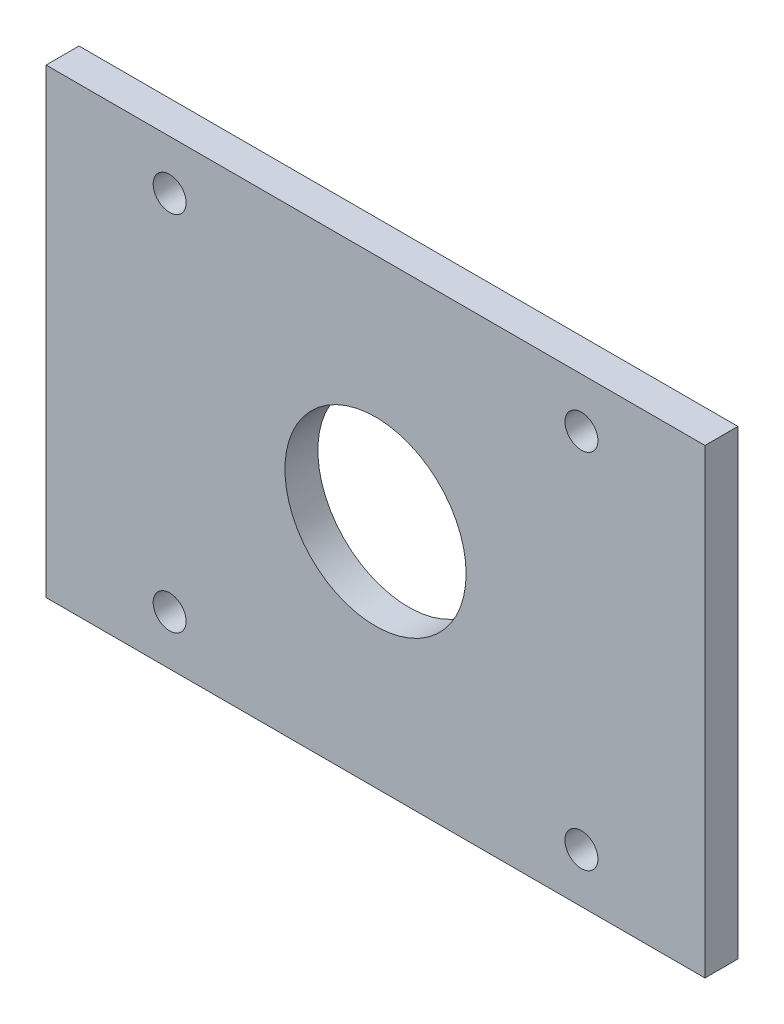
ISO-10303-21;
HEADER;
FILE_DESCRIPTION(('STEP AP214'),'2;1');
FILE_NAME('part.step','',(''),(''),'','','');
FILE_SCHEMA(('AUTOMOTIVE_DESIGN { 1 0 10303 214 1 1 1 1 }'));
ENDSEC;
DATA;
#1=APPLICATION_CONTEXT('core data for automotive mechanical design processes');
#2=APPLICATION_PROTOCOL_DEFINITION('international standard','automotive_design',2000,#1);
#3=PRODUCT_CONTEXT('',#1,'mechanical');
#4=PRODUCT('Part','Part','',(#3));
#5=PRODUCT_RELATED_PRODUCT_CATEGORY('part','',(#4));
#6=PRODUCT_DEFINITION_FORMATION('','',#4);
#7=PRODUCT_DEFINITION_CONTEXT('part definition',#1,'design');
#8=PRODUCT_DEFINITION('design','',#6,#7);
#9=PRODUCT_DEFINITION_SHAPE('','',#8);
#10=(LENGTH_UNIT() NAMED_UNIT(*) SI_UNIT(.MILLI.,.METRE.));
#11=(NAMED_UNIT(*) PLANE_ANGLE_UNIT() SI_UNIT($,.RADIAN.));
#12=(NAMED_UNIT(*) SI_UNIT($,.STERADIAN.) SOLID_ANGLE_UNIT());
#13=UNCERTAINTY_MEASURE_WITH_UNIT(LENGTH_MEASURE(1.E-05),#10,'distance_accuracy_value','');
#14=(GEOMETRIC_REPRESENTATION_CONTEXT(3) GLOBAL_UNCERTAINTY_ASSIGNED_CONTEXT((#13)) GLOBAL_UNIT_ASSIGNED_CONTEXT((#10,
#11,#12)) REPRESENTATION_CONTEXT('',''));
#15=CARTESIAN_POINT('',(0.,0.,0.));
#16=DIRECTION('',(0.,0.,1.));
#17=DIRECTION('',(1.,0.,0.));
#18=AXIS2_PLACEMENT_3D('',#15,#16,#17);
#19=CARTESIAN_POINT('',(0.,0.,4.));
#20=DIRECTION('',(0.,0.,1.));
#21=DIRECTION('',(1.,0.,0.));
#22=AXIS2_PLACEMENT_3D('',#19,#20,#21);
#23=PLANE('',#22);
#24=CARTESIAN_POINT('',(-25.0000000000322,28.9999999999994,4.));
#25=DIRECTION('',(0.,0.,1.));
#26=DIRECTION('',(1.,0.,0.));
#27=AXIS2_PLACEMENT_3D('',#24,#25,#26);
#28=CIRCLE('',#27,2.);
#29=CARTESIAN_POINT('',(-23.0000000000322,28.9999999999994,4.));
#30=VERTEX_POINT('',#29);
#31=EDGE_CURVE('E175',#30,#30,#28,.T.);
#32=ORIENTED_EDGE('',*,*,#31,.F.);
#33=EDGE_LOOP('',(#32));
#34=FACE_BOUND('',#33,.T.);
#35=CARTESIAN_POINT('',(-25.0000000000322,-15.0000000000006,4.));
#36=DIRECTION('',(0.,0.,1.));
#37=DIRECTION('',(1.,0.,0.));
#38=AXIS2_PLACEMENT_3D('',#35,#36,#37);
#39=CIRCLE('',#38,2.);
#40=CARTESIAN_POINT('',(-23.0000000000322,-15.0000000000006,4.));
#41=VERTEX_POINT('',#40);
#42=EDGE_CURVE('E116',#41,#41,#39,.T.);
#43=ORIENTED_EDGE('',*,*,#42,.F.);
#44=EDGE_LOOP('',(#43));
#45=FACE_BOUND('',#44,.T.);
#46=DIRECTION('',(0.,-1.,0.));
#47=VECTOR('',#46,1.);
#48=CARTESIAN_POINT('',(-40.0000000000322,-21.0000000000006,4.));
#49=LINE('',#48,#47);
#50=CARTESIAN_POINT('',(-40.0000000000322,35.0000000000011,4.));
#51=VERTEX_POINT('',#50);
#52=CARTESIAN_POINT('',(-40.0000000000322,-21.0000000000006,4.));
#53=VERTEX_POINT('',#52);
#54=EDGE_CURVE('E86',#51,#53,#49,.T.);
#55=ORIENTED_EDGE('',*,*,#54,.T.);
#56=DIRECTION('',(1.,0.,0.));
#57=VECTOR('',#56,1.);
#58=CARTESIAN_POINT('',(39.9999999999695,-21.0000000000006,4.));
#59=LINE('',#58,#57);
#60=CARTESIAN_POINT('',(39.9999999999695,-21.0000000000006,4.));
#61=VERTEX_POINT('',#60);
#62=EDGE_CURVE('E81',#53,#61,#59,.T.);
#63=ORIENTED_EDGE('',*,*,#62,.T.);
#64=DIRECTION('',(0.,1.,0.));
#65=VECTOR('',#64,1.);
#66=CARTESIAN_POINT('',(39.9999999999695,-21.0000000000006,4.));
#67=LINE('',#66,#65);
#68=CARTESIAN_POINT('',(39.9999999999695,35.0000000000011,4.));
#69=VERTEX_POINT('',#68);
#70=EDGE_CURVE('E84',#61,#69,#67,.T.);
#71=ORIENTED_EDGE('',*,*,#70,.T.);
#72=DIRECTION('',(-1.,0.,0.));
#73=VECTOR('',#72,1.);
#74=CARTESIAN_POINT('',(39.9999999999695,35.0000000000011,4.));
#75=LINE('',#74,#73);
#76=EDGE_CURVE('E50',#69,#51,#75,.T.);
#77=ORIENTED_EDGE('',*,*,#76,.T.);
#78=EDGE_LOOP('',(#55,#63,#71,#77));
#79=FACE_BOUND('',#78,.T.);
#80=CARTESIAN_POINT('',(-3.13568615517568E-11,7.00000000000025,4.));
#81=DIRECTION('',(0.,0.,1.));
#82=DIRECTION('',(1.,0.,0.));
#83=AXIS2_PLACEMENT_3D('',#80,#81,#82);
#84=CIRCLE('',#83,11.);
#85=CARTESIAN_POINT('',(10.9999999999686,7.00000000000025,4.));
#86=VERTEX_POINT('',#85);
#87=EDGE_CURVE('E104',#86,#86,#84,.T.);
#88=ORIENTED_EDGE('',*,*,#87,.F.);
#89=EDGE_LOOP('',(#88));
#90=FACE_BOUND('',#89,.T.);
#91=CARTESIAN_POINT('',(24.9999999999678,-15.0000000000006,4.));
#92=DIRECTION('',(0.,0.,1.));
#93=DIRECTION('',(1.,0.,0.));
#94=AXIS2_PLACEMENT_3D('',#91,#92,#93);
#95=CIRCLE('',#94,2.);
#96=CARTESIAN_POINT('',(26.9999999999678,-15.0000000000006,4.));
#97=VERTEX_POINT('',#96);
#98=EDGE_CURVE('E111',#97,#97,#95,.T.);
#99=ORIENTED_EDGE('',*,*,#98,.F.);
#100=EDGE_LOOP('',(#99));
#101=FACE_BOUND('',#100,.T.);
#102=CARTESIAN_POINT('',(24.9999999999678,28.9999999999994,4.));
#103=DIRECTION('',(0.,0.,1.));
#104=DIRECTION('',(1.,0.,0.));
#105=AXIS2_PLACEMENT_3D('',#102,#103,#104);
#106=CIRCLE('',#105,2.);
#107=CARTESIAN_POINT('',(26.9999999999678,28.9999999999994,4.));
#108=VERTEX_POINT('',#107);
#109=EDGE_CURVE('E42',#108,#108,#106,.T.);
#110=ORIENTED_EDGE('',*,*,#109,.F.);
#111=EDGE_LOOP('',(#110));
#112=FACE_BOUND('',#111,.T.);
#113=ADVANCED_FACE('F33',(#34,#45,#79,#90,#101,#112),#23,.T.);
#114=CARTESIAN_POINT('',(0.,0.,0.));
#115=DIRECTION('',(0.,0.,1.));
#116=DIRECTION('',(1.,0.,0.));
#117=AXIS2_PLACEMENT_3D('',#114,#115,#116);
#118=PLANE('',#117);
#119=CARTESIAN_POINT('',(-25.0000000000322,28.9999999999994,0.));
#120=DIRECTION('',(0.,0.,1.));
#121=DIRECTION('',(1.,0.,0.));
#122=AXIS2_PLACEMENT_3D('',#119,#120,#121);
#123=CIRCLE('',#122,2.);
#124=CARTESIAN_POINT('',(-23.0000000000322,28.9999999999994,0.));
#125=VERTEX_POINT('',#124);
#126=EDGE_CURVE('E178',#125,#125,#123,.T.);
#127=ORIENTED_EDGE('',*,*,#126,.T.);
#128=EDGE_LOOP('',(#127));
#129=FACE_BOUND('',#128,.T.);
#130=CARTESIAN_POINT('',(-25.0000000000322,-15.0000000000006,0.));
#131=DIRECTION('',(0.,0.,1.));
#132=DIRECTION('',(1.,0.,0.));
#133=AXIS2_PLACEMENT_3D('',#130,#131,#132);
#134=CIRCLE('',#133,2.);
#135=CARTESIAN_POINT('',(-23.0000000000322,-15.0000000000006,0.));
#136=VERTEX_POINT('',#135);
#137=EDGE_CURVE('E112',#136,#136,#134,.T.);
#138=ORIENTED_EDGE('',*,*,#137,.T.);
#139=EDGE_LOOP('',(#138));
#140=FACE_BOUND('',#139,.T.);
#141=DIRECTION('',(0.,-1.,0.));
#142=VECTOR('',#141,1.);
#143=CARTESIAN_POINT('',(-40.0000000000322,-21.0000000000006,0.));
#144=LINE('',#143,#142);
#145=CARTESIAN_POINT('',(-40.0000000000322,35.0000000000011,0.));
#146=VERTEX_POINT('',#145);
#147=CARTESIAN_POINT('',(-40.0000000000322,-21.0000000000006,0.));
#148=VERTEX_POINT('',#147);
#149=EDGE_CURVE('E101',#146,#148,#144,.T.);
#150=ORIENTED_EDGE('',*,*,#149,.F.);
#151=DIRECTION('',(-1.,0.,0.));
#152=VECTOR('',#151,1.);
#153=CARTESIAN_POINT('',(39.9999999999695,35.0000000000011,0.));
#154=LINE('',#153,#152);
#155=CARTESIAN_POINT('',(39.9999999999695,35.0000000000011,0.));
#156=VERTEX_POINT('',#155);
#157=EDGE_CURVE('E73',#156,#146,#154,.T.);
#158=ORIENTED_EDGE('',*,*,#157,.F.);
#159=DIRECTION('',(0.,1.,0.));
#160=VECTOR('',#159,1.);
#161=CARTESIAN_POINT('',(39.9999999999695,-21.0000000000006,0.));
#162=LINE('',#161,#160);
#163=CARTESIAN_POINT('',(39.9999999999695,-21.0000000000006,0.));
#164=VERTEX_POINT('',#163);
#165=EDGE_CURVE('E67',#164,#156,#162,.T.);
#166=ORIENTED_EDGE('',*,*,#165,.F.);
#167=DIRECTION('',(1.,0.,0.));
#168=VECTOR('',#167,1.);
#169=CARTESIAN_POINT('',(39.9999999999695,-21.0000000000006,0.));
#170=LINE('',#169,#168);
#171=EDGE_CURVE('E91',#148,#164,#170,.T.);
#172=ORIENTED_EDGE('',*,*,#171,.F.);
#173=EDGE_LOOP('',(#150,#158,#166,#172));
#174=FACE_BOUND('',#173,.T.);
#175=CARTESIAN_POINT('',(-3.13568615517568E-11,7.00000000000025,0.));
#176=DIRECTION('',(0.,0.,1.));
#177=DIRECTION('',(1.,0.,0.));
#178=AXIS2_PLACEMENT_3D('',#175,#176,#177);
#179=CIRCLE('',#178,11.);
#180=CARTESIAN_POINT('',(10.9999999999686,7.00000000000025,0.));
#181=VERTEX_POINT('',#180);
#182=EDGE_CURVE('E115',#181,#181,#179,.T.);
#183=ORIENTED_EDGE('',*,*,#182,.T.);
#184=EDGE_LOOP('',(#183));
#185=FACE_BOUND('',#184,.T.);
#186=CARTESIAN_POINT('',(24.9999999999678,-15.0000000000006,0.));
#187=DIRECTION('',(0.,0.,1.));
#188=DIRECTION('',(1.,0.,0.));
#189=AXIS2_PLACEMENT_3D('',#186,#187,#188);
#190=CIRCLE('',#189,2.);
#191=CARTESIAN_POINT('',(26.9999999999678,-15.0000000000006,0.));
#192=VERTEX_POINT('',#191);
#193=EDGE_CURVE('E119',#192,#192,#190,.T.);
#194=ORIENTED_EDGE('',*,*,#193,.T.);
#195=EDGE_LOOP('',(#194));
#196=FACE_BOUND('',#195,.T.);
#197=CARTESIAN_POINT('',(24.9999999999678,28.9999999999994,0.));
#198=DIRECTION('',(0.,0.,1.));
#199=DIRECTION('',(1.,0.,0.));
#200=AXIS2_PLACEMENT_3D('',#197,#198,#199);
#201=CIRCLE('',#200,2.);
#202=CARTESIAN_POINT('',(26.9999999999678,28.9999999999994,0.));
#203=VERTEX_POINT('',#202);
#204=EDGE_CURVE('E11',#203,#203,#201,.T.);
#205=ORIENTED_EDGE('',*,*,#204,.T.);
#206=EDGE_LOOP('',(#205));
#207=FACE_BOUND('',#206,.T.);
#208=ADVANCED_FACE('F127',(#129,#140,#174,#185,#196,#207),#118,.F.);
#209=CARTESIAN_POINT('',(-40.0000000000322,-21.0000000000006,4.));
#210=DIRECTION('',(1.,0.,0.));
#211=DIRECTION('',(0.,0.,-1.));
#212=AXIS2_PLACEMENT_3D('',#209,#210,#211);
#213=PLANE('',#212);
#214=ORIENTED_EDGE('',*,*,#149,.T.);
#215=DIRECTION('',(0.,0.,-1.));
#216=VECTOR('',#215,1.);
#217=CARTESIAN_POINT('',(-40.0000000000322,-21.0000000000006,4.));
#218=LINE('',#217,#216);
#219=EDGE_CURVE('E92',#53,#148,#218,.T.);
#220=ORIENTED_EDGE('',*,*,#219,.F.);
#221=ORIENTED_EDGE('',*,*,#54,.F.);
#222=DIRECTION('',(0.,0.,-1.));
#223=VECTOR('',#222,1.);
#224=CARTESIAN_POINT('',(-40.0000000000322,35.0000000000011,4.));
#225=LINE('',#224,#223);
#226=EDGE_CURVE('E97',#51,#146,#225,.T.);
#227=ORIENTED_EDGE('',*,*,#226,.T.);
#228=EDGE_LOOP('',(#214,#220,#221,#227));
#229=FACE_BOUND('',#228,.T.);
#230=ADVANCED_FACE('F133',(#229),#213,.F.);
#231=CARTESIAN_POINT('',(39.9999999999695,-21.0000000000006,4.));
#232=DIRECTION('',(0.,1.,0.));
#233=DIRECTION('',(0.,0.,1.));
#234=AXIS2_PLACEMENT_3D('',#231,#232,#233);
#235=PLANE('',#234);
#236=ORIENTED_EDGE('',*,*,#171,.T.);
#237=DIRECTION('',(0.,0.,-1.));
#238=VECTOR('',#237,1.);
#239=CARTESIAN_POINT('',(39.9999999999695,-21.0000000000006,4.));
#240=LINE('',#239,#238);
#241=EDGE_CURVE('E89',#61,#164,#240,.T.);
#242=ORIENTED_EDGE('',*,*,#241,.F.);
#243=ORIENTED_EDGE('',*,*,#62,.F.);
#244=ORIENTED_EDGE('',*,*,#219,.T.);
#245=EDGE_LOOP('',(#236,#242,#243,#244));
#246=FACE_BOUND('',#245,.T.);
#247=ADVANCED_FACE('F90',(#246),#235,.F.);
#248=CARTESIAN_POINT('',(39.9999999999695,-21.0000000000006,4.));
#249=DIRECTION('',(-1.,0.,0.));
#250=DIRECTION('',(0.,0.,1.));
#251=AXIS2_PLACEMENT_3D('',#248,#249,#250);
#252=PLANE('',#251);
#253=ORIENTED_EDGE('',*,*,#165,.T.);
#254=DIRECTION('',(0.,0.,-1.));
#255=VECTOR('',#254,1.);
#256=CARTESIAN_POINT('',(39.9999999999695,35.0000000000011,4.));
#257=LINE('',#256,#255);
#258=EDGE_CURVE('E93',#69,#156,#257,.T.);
#259=ORIENTED_EDGE('',*,*,#258,.F.);
#260=ORIENTED_EDGE('',*,*,#70,.F.);
#261=ORIENTED_EDGE('',*,*,#241,.T.);
#262=EDGE_LOOP('',(#253,#259,#260,#261));
#263=FACE_BOUND('',#262,.T.);
#264=ADVANCED_FACE('F95',(#263),#252,.F.);
#265=CARTESIAN_POINT('',(39.9999999999695,35.0000000000011,4.));
#266=DIRECTION('',(0.,-1.,0.));
#267=DIRECTION('',(0.,0.,-1.));
#268=AXIS2_PLACEMENT_3D('',#265,#266,#267);
#269=PLANE('',#268);
#270=ORIENTED_EDGE('',*,*,#157,.T.);
#271=ORIENTED_EDGE('',*,*,#226,.F.);
#272=ORIENTED_EDGE('',*,*,#76,.F.);
#273=ORIENTED_EDGE('',*,*,#258,.T.);
#274=EDGE_LOOP('',(#270,#271,#272,#273));
#275=FACE_BOUND('',#274,.T.);
#276=ADVANCED_FACE('F142',(#275),#269,.F.);
#277=CARTESIAN_POINT('',(-3.13568615517568E-11,7.00000000000025,4.));
#278=DIRECTION('',(0.,0.,-1.));
#279=DIRECTION('',(-1.,0.,0.));
#280=AXIS2_PLACEMENT_3D('',#277,#278,#279);
#281=CYLINDRICAL_SURFACE('',#280,11.);
#282=ORIENTED_EDGE('',*,*,#87,.T.);
#283=EDGE_LOOP('',(#282));
#284=FACE_BOUND('',#283,.T.);
#285=ORIENTED_EDGE('',*,*,#182,.F.);
#286=EDGE_LOOP('',(#285));
#287=FACE_BOUND('',#286,.T.);
#288=ADVANCED_FACE('F139',(#284,#287),#281,.F.);
#289=CARTESIAN_POINT('',(-25.0000000000322,-15.0000000000006,-96.));
#290=DIRECTION('',(0.,0.,1.));
#291=DIRECTION('',(1.,0.,0.));
#292=AXIS2_PLACEMENT_3D('',#289,#290,#291);
#293=CYLINDRICAL_SURFACE('',#292,2.);
#294=ORIENTED_EDGE('',*,*,#42,.T.);
#295=EDGE_LOOP('',(#294));
#296=FACE_BOUND('',#295,.T.);
#297=ORIENTED_EDGE('',*,*,#137,.F.);
#298=EDGE_LOOP('',(#297));
#299=FACE_BOUND('',#298,.T.);
#300=ADVANCED_FACE('F159',(#296,#299),#293,.F.);
#301=CARTESIAN_POINT('',(-25.0000000000322,28.9999999999994,-96.));
#302=DIRECTION('',(0.,0.,1.));
#303=DIRECTION('',(1.,0.,0.));
#304=AXIS2_PLACEMENT_3D('',#301,#302,#303);
#305=CYLINDRICAL_SURFACE('',#304,2.);
#306=ORIENTED_EDGE('',*,*,#31,.T.);
#307=EDGE_LOOP('',(#306));
#308=FACE_BOUND('',#307,.T.);
#309=ORIENTED_EDGE('',*,*,#126,.F.);
#310=EDGE_LOOP('',(#309));
#311=FACE_BOUND('',#310,.T.);
#312=ADVANCED_FACE('F153',(#308,#311),#305,.F.);
#313=CARTESIAN_POINT('',(24.9999999999678,-15.0000000000006,-96.));
#314=DIRECTION('',(0.,0.,1.));
#315=DIRECTION('',(1.,0.,0.));
#316=AXIS2_PLACEMENT_3D('',#313,#314,#315);
#317=CYLINDRICAL_SURFACE('',#316,2.);
#318=ORIENTED_EDGE('',*,*,#98,.T.);
#319=EDGE_LOOP('',(#318));
#320=FACE_BOUND('',#319,.T.);
#321=ORIENTED_EDGE('',*,*,#193,.F.);
#322=EDGE_LOOP('',(#321));
#323=FACE_BOUND('',#322,.T.);
#324=ADVANCED_FACE('F151',(#320,#323),#317,.F.);
#325=CARTESIAN_POINT('',(24.9999999999678,28.9999999999994,-96.));
#326=DIRECTION('',(0.,0.,1.));
#327=DIRECTION('',(1.,0.,0.));
#328=AXIS2_PLACEMENT_3D('',#325,#326,#327);
#329=CYLINDRICAL_SURFACE('',#328,2.);
#330=ORIENTED_EDGE('',*,*,#109,.T.);
#331=EDGE_LOOP('',(#330));
#332=FACE_BOUND('',#331,.T.);
#333=ORIENTED_EDGE('',*,*,#204,.F.);
#334=EDGE_LOOP('',(#333));
#335=FACE_BOUND('',#334,.T.);
#336=ADVANCED_FACE('F35',(#332,#335),#329,.F.);
#337=CLOSED_SHELL('',(#113,#208,#230,#247,#264,#276,#288,#300,#312,#324,#336));
#338=MANIFOLD_SOLID_BREP('B2',#337);
#339=ADVANCED_BREP_SHAPE_REPRESENTATION('',(#18,#338),#14);
#340=SHAPE_DEFINITION_REPRESENTATION(#9,#339);
ENDSEC;
END-ISO-10303-21;
